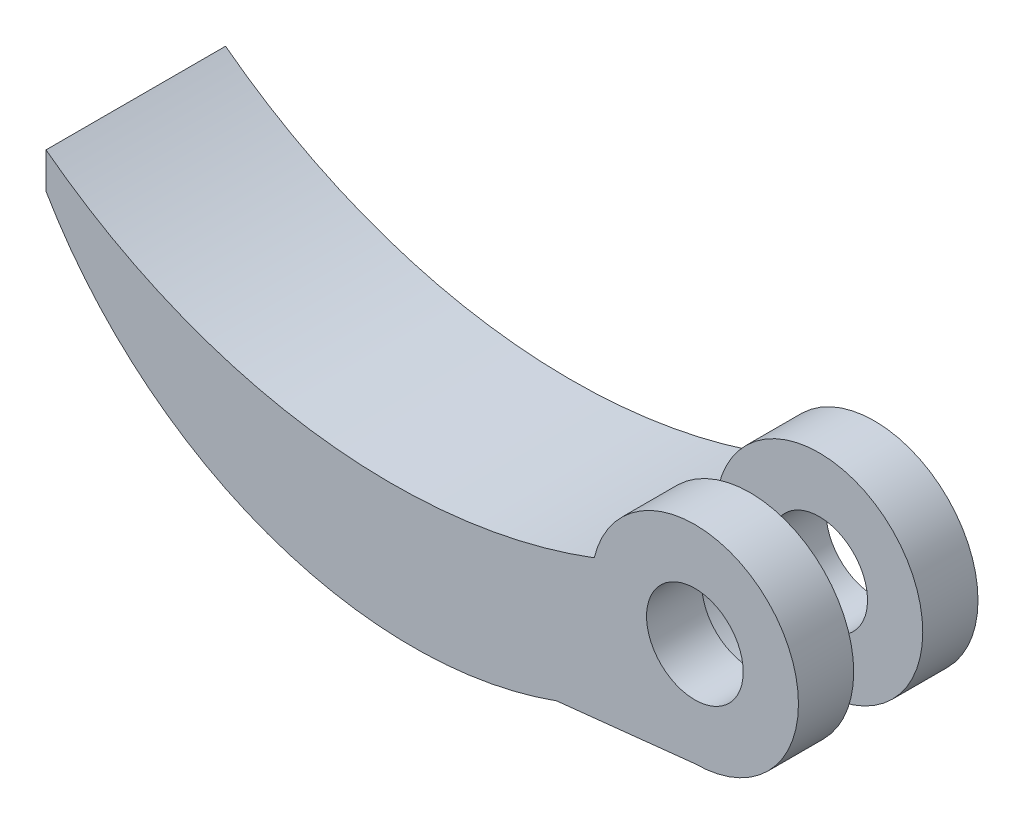
ISO-10303-21;
HEADER;
FILE_DESCRIPTION(('STEP AP214'),'2;1');
FILE_NAME('part.step','',(''),(''),'','','');
FILE_SCHEMA(('AUTOMOTIVE_DESIGN { 1 0 10303 214 1 1 1 1 }'));
ENDSEC;
DATA;
#1=APPLICATION_CONTEXT('core data for automotive mechanical design processes');
#2=APPLICATION_PROTOCOL_DEFINITION('international standard','automotive_design',2000,#1);
#3=PRODUCT_CONTEXT('',#1,'mechanical');
#4=PRODUCT('Part','Part','',(#3));
#5=PRODUCT_RELATED_PRODUCT_CATEGORY('part','',(#4));
#6=PRODUCT_DEFINITION_FORMATION('','',#4);
#7=PRODUCT_DEFINITION_CONTEXT('part definition',#1,'design');
#8=PRODUCT_DEFINITION('design','',#6,#7);
#9=PRODUCT_DEFINITION_SHAPE('','',#8);
#10=(LENGTH_UNIT() NAMED_UNIT(*) SI_UNIT(.MILLI.,.METRE.));
#11=(NAMED_UNIT(*) PLANE_ANGLE_UNIT() SI_UNIT($,.RADIAN.));
#12=(NAMED_UNIT(*) SI_UNIT($,.STERADIAN.) SOLID_ANGLE_UNIT());
#13=UNCERTAINTY_MEASURE_WITH_UNIT(LENGTH_MEASURE(1.E-05),#10,'distance_accuracy_value','');
#14=(GEOMETRIC_REPRESENTATION_CONTEXT(3) GLOBAL_UNCERTAINTY_ASSIGNED_CONTEXT((#13)) GLOBAL_UNIT_ASSIGNED_CONTEXT((#10,
#11,#12)) REPRESENTATION_CONTEXT('',''));
#15=CARTESIAN_POINT('',(0.,0.,0.));
#16=DIRECTION('',(0.,0.,1.));
#17=DIRECTION('',(1.,0.,0.));
#18=AXIS2_PLACEMENT_3D('',#15,#16,#17);
#19=CARTESIAN_POINT('',(0.,0.,-9.));
#20=DIRECTION('',(0.,0.,1.));
#21=DIRECTION('',(1.,0.,0.));
#22=AXIS2_PLACEMENT_3D('',#19,#20,#21);
#23=CYLINDRICAL_SURFACE('',#22,7.5);
#24=DIRECTION('',(0.,0.,1.));
#25=VECTOR('',#24,1.);
#26=CARTESIAN_POINT('',(0.,-7.5,-9.));
#27=LINE('',#26,#25);
#28=CARTESIAN_POINT('',(0.,-7.5,-5.));
#29=VERTEX_POINT('',#28);
#30=CARTESIAN_POINT('',(0.,-7.5,0.));
#31=VERTEX_POINT('',#30);
#32=EDGE_CURVE('E59',#29,#31,#27,.T.);
#33=ORIENTED_EDGE('',*,*,#32,.F.);
#34=CARTESIAN_POINT('',(0.,0.,-5.));
#35=DIRECTION('',(0.,0.,-1.));
#36=DIRECTION('',(-1.,0.,0.));
#37=AXIS2_PLACEMENT_3D('',#34,#35,#36);
#38=CIRCLE('',#37,7.5);
#39=CARTESIAN_POINT('',(-7.28877143549675,1.76743060997776,-5.));
#40=VERTEX_POINT('',#39);
#41=EDGE_CURVE('E54',#29,#40,#38,.T.);
#42=ORIENTED_EDGE('',*,*,#41,.T.);
#43=DIRECTION('',(0.,0.,1.));
#44=VECTOR('',#43,1.);
#45=CARTESIAN_POINT('',(-7.28877143549675,1.76743060997776,-9.));
#46=LINE('',#45,#44);
#47=CARTESIAN_POINT('',(-7.28877143549675,1.76743060997776,0.));
#48=VERTEX_POINT('',#47);
#49=EDGE_CURVE('E115',#40,#48,#46,.T.);
#50=ORIENTED_EDGE('',*,*,#49,.T.);
#51=CARTESIAN_POINT('',(0.,0.,0.));
#52=DIRECTION('',(0.,0.,1.));
#53=DIRECTION('',(1.,0.,0.));
#54=AXIS2_PLACEMENT_3D('',#51,#52,#53);
#55=CIRCLE('',#54,7.5);
#56=EDGE_CURVE('E163',#48,#31,#55,.T.);
#57=ORIENTED_EDGE('',*,*,#56,.T.);
#58=EDGE_LOOP('',(#33,#42,#50,#57));
#59=FACE_BOUND('',#58,.T.);
#60=ADVANCED_FACE('F39',(#59),#23,.F.);
#61=CARTESIAN_POINT('',(0.,0.,4.));
#62=DIRECTION('',(0.,0.,1.));
#63=DIRECTION('',(1.,0.,0.));
#64=AXIS2_PLACEMENT_3D('',#61,#62,#63);
#65=PLANE('',#64);
#66=CARTESIAN_POINT('',(0.,0.,4.));
#67=DIRECTION('',(0.,0.,1.));
#68=DIRECTION('',(1.,0.,0.));
#69=AXIS2_PLACEMENT_3D('',#66,#67,#68);
#70=CIRCLE('',#69,7.5);
#71=CARTESIAN_POINT('',(0.,-7.5,4.));
#72=VERTEX_POINT('',#71);
#73=CARTESIAN_POINT('',(-7.28877143549675,1.76743060997776,4.));
#74=VERTEX_POINT('',#73);
#75=EDGE_CURVE('E160',#72,#74,#70,.T.);
#76=ORIENTED_EDGE('',*,*,#75,.T.);
#77=CARTESIAN_POINT('',(-21.9545188477538,40.5061940782808,4.));
#78=DIRECTION('',(0.,0.,-1.));
#79=DIRECTION('',(-1.,0.,0.));
#80=AXIS2_PLACEMENT_3D('',#77,#78,#79);
#81=CIRCLE('',#80,41.4219258631616);
#82=CARTESIAN_POINT('',(-46.9818458061031,7.49999999999999,4.));
#83=VERTEX_POINT('',#82);
#84=EDGE_CURVE('E143',#74,#83,#81,.T.);
#85=ORIENTED_EDGE('',*,*,#84,.T.);
#86=DIRECTION('',(0.,-1.,0.));
#87=VECTOR('',#86,1.);
#88=CARTESIAN_POINT('',(-46.9818458061031,4.90393409006629,4.));
#89=LINE('',#88,#87);
#90=CARTESIAN_POINT('',(-46.9818458061031,4.90393409006629,4.));
#91=VERTEX_POINT('',#90);
#92=EDGE_CURVE('E138',#83,#91,#89,.T.);
#93=ORIENTED_EDGE('',*,*,#92,.T.);
#94=CARTESIAN_POINT('',(-20.4372430160604,20.2856612233375,4.));
#95=DIRECTION('',(0.,0.,1.));
#96=DIRECTION('',(-1.,0.,0.));
#97=AXIS2_PLACEMENT_3D('',#94,#95,#96);
#98=CIRCLE('',#97,30.679202513813);
#99=CARTESIAN_POINT('',(-10.009282788127,-8.56691426600475,4.));
#100=VERTEX_POINT('',#99);
#101=EDGE_CURVE('E124',#91,#100,#98,.T.);
#102=ORIENTED_EDGE('',*,*,#101,.T.);
#103=DIRECTION('',(0.994366978123419,0.105992041294143,0.));
#104=VECTOR('',#103,1.);
#105=CARTESIAN_POINT('',(-10.009282788127,-8.56691426600475,4.));
#106=LINE('',#105,#104);
#107=EDGE_CURVE('E128',#100,#72,#106,.T.);
#108=ORIENTED_EDGE('',*,*,#107,.T.);
#109=EDGE_LOOP('',(#76,#85,#93,#102,#108));
#110=FACE_BOUND('',#109,.T.);
#111=CARTESIAN_POINT('',(0.,0.,4.));
#112=DIRECTION('',(0.,0.,1.));
#113=DIRECTION('',(1.,0.,0.));
#114=AXIS2_PLACEMENT_3D('',#111,#112,#113);
#115=CIRCLE('',#114,3.5);
#116=CARTESIAN_POINT('',(3.5,0.,4.));
#117=VERTEX_POINT('',#116);
#118=EDGE_CURVE('E154',#117,#117,#115,.T.);
#119=ORIENTED_EDGE('',*,*,#118,.F.);
#120=EDGE_LOOP('',(#119));
#121=FACE_BOUND('',#120,.T.);
#122=ADVANCED_FACE('F177',(#110,#121),#65,.T.);
#123=CARTESIAN_POINT('',(0.,0.,0.));
#124=DIRECTION('',(0.,0.,1.));
#125=DIRECTION('',(1.,0.,0.));
#126=AXIS2_PLACEMENT_3D('',#123,#124,#125);
#127=PLANE('',#126);
#128=ORIENTED_EDGE('',*,*,#56,.F.);
#129=EDGE_CURVE('E157',#31,#48,#55,.T.);
#130=ORIENTED_EDGE('',*,*,#129,.F.);
#131=EDGE_LOOP('',(#128,#130));
#132=FACE_BOUND('',#131,.T.);
#133=CARTESIAN_POINT('',(0.,0.,0.));
#134=DIRECTION('',(0.,0.,1.));
#135=DIRECTION('',(1.,0.,0.));
#136=AXIS2_PLACEMENT_3D('',#133,#134,#135);
#137=CIRCLE('',#136,3.5);
#138=CARTESIAN_POINT('',(3.5,0.,0.));
#139=VERTEX_POINT('',#138);
#140=EDGE_CURVE('E150',#139,#139,#137,.T.);
#141=ORIENTED_EDGE('',*,*,#140,.T.);
#142=EDGE_LOOP('',(#141));
#143=FACE_BOUND('',#142,.T.);
#144=ADVANCED_FACE('F174',(#132,#143),#127,.F.);
#145=CARTESIAN_POINT('',(0.,0.,4.));
#146=DIRECTION('',(0.,0.,-1.));
#147=DIRECTION('',(-1.,0.,0.));
#148=AXIS2_PLACEMENT_3D('',#145,#146,#147);
#149=CYLINDRICAL_SURFACE('',#148,7.5);
#150=ORIENTED_EDGE('',*,*,#129,.T.);
#151=DIRECTION('',(0.,0.,1.));
#152=VECTOR('',#151,1.);
#153=CARTESIAN_POINT('',(-7.28877143549678,1.76743060997776,-2.5));
#154=LINE('',#153,#152);
#155=EDGE_CURVE('E11',#48,#74,#154,.T.);
#156=ORIENTED_EDGE('',*,*,#155,.T.);
#157=ORIENTED_EDGE('',*,*,#75,.F.);
#158=DIRECTION('',(0.,0.,-1.));
#159=VECTOR('',#158,1.);
#160=CARTESIAN_POINT('',(0.,-7.5,4.));
#161=LINE('',#160,#159);
#162=EDGE_CURVE('E47',#72,#31,#161,.T.);
#163=ORIENTED_EDGE('',*,*,#162,.T.);
#164=EDGE_LOOP('',(#150,#156,#157,#163));
#165=FACE_BOUND('',#164,.T.);
#166=ADVANCED_FACE('F41',(#165),#149,.T.);
#167=CARTESIAN_POINT('',(0.,0.,4.));
#168=DIRECTION('',(0.,0.,-1.));
#169=DIRECTION('',(-1.,0.,0.));
#170=AXIS2_PLACEMENT_3D('',#167,#168,#169);
#171=CYLINDRICAL_SURFACE('',#170,3.5);
#172=ORIENTED_EDGE('',*,*,#118,.T.);
#173=EDGE_LOOP('',(#172));
#174=FACE_BOUND('',#173,.T.);
#175=ORIENTED_EDGE('',*,*,#140,.F.);
#176=EDGE_LOOP('',(#175));
#177=FACE_BOUND('',#176,.T.);
#178=ADVANCED_FACE('F193',(#174,#177),#171,.F.);
#179=CARTESIAN_POINT('',(-20.4372430160604,20.2856612233375,-9.));
#180=DIRECTION('',(0.,0.,1.));
#181=DIRECTION('',(1.,0.,0.));
#182=AXIS2_PLACEMENT_3D('',#179,#180,#181);
#183=CYLINDRICAL_SURFACE('',#182,30.679202513813);
#184=ORIENTED_EDGE('',*,*,#101,.F.);
#185=DIRECTION('',(0.,0.,1.));
#186=VECTOR('',#185,1.);
#187=CARTESIAN_POINT('',(-46.9818458061031,4.90393409006629,-9.));
#188=LINE('',#187,#186);
#189=CARTESIAN_POINT('',(-46.9818458061031,4.90393409006629,-9.));
#190=VERTEX_POINT('',#189);
#191=EDGE_CURVE('E148',#190,#91,#188,.T.);
#192=ORIENTED_EDGE('',*,*,#191,.F.);
#193=CARTESIAN_POINT('',(-20.4372430160604,20.2856612233375,-9.));
#194=DIRECTION('',(0.,0.,1.));
#195=DIRECTION('',(-1.,0.,0.));
#196=AXIS2_PLACEMENT_3D('',#193,#194,#195);
#197=CIRCLE('',#196,30.679202513813);
#198=CARTESIAN_POINT('',(-10.009282788127,-8.56691426600475,-9.));
#199=VERTEX_POINT('',#198);
#200=EDGE_CURVE('E135',#190,#199,#197,.T.);
#201=ORIENTED_EDGE('',*,*,#200,.T.);
#202=DIRECTION('',(0.,0.,1.));
#203=VECTOR('',#202,1.);
#204=CARTESIAN_POINT('',(-10.009282788127,-8.56691426600475,-9.));
#205=LINE('',#204,#203);
#206=EDGE_CURVE('E140',#199,#100,#205,.T.);
#207=ORIENTED_EDGE('',*,*,#206,.T.);
#208=EDGE_LOOP('',(#184,#192,#201,#207));
#209=FACE_BOUND('',#208,.T.);
#210=ADVANCED_FACE('F183',(#209),#183,.T.);
#211=CARTESIAN_POINT('',(-46.9818458061031,4.90393409006629,-9.));
#212=DIRECTION('',(-1.,0.,0.));
#213=DIRECTION('',(0.,0.,1.));
#214=AXIS2_PLACEMENT_3D('',#211,#212,#213);
#215=PLANE('',#214);
#216=ORIENTED_EDGE('',*,*,#92,.F.);
#217=DIRECTION('',(0.,0.,1.));
#218=VECTOR('',#217,1.);
#219=CARTESIAN_POINT('',(-46.9818458061031,7.49999999999999,-9.));
#220=LINE('',#219,#218);
#221=CARTESIAN_POINT('',(-46.9818458061031,7.49999999999999,-9.));
#222=VERTEX_POINT('',#221);
#223=EDGE_CURVE('E119',#222,#83,#220,.T.);
#224=ORIENTED_EDGE('',*,*,#223,.F.);
#225=DIRECTION('',(0.,-1.,0.));
#226=VECTOR('',#225,1.);
#227=CARTESIAN_POINT('',(-46.9818458061031,4.90393409006629,-9.));
#228=LINE('',#227,#226);
#229=EDGE_CURVE('E107',#222,#190,#228,.T.);
#230=ORIENTED_EDGE('',*,*,#229,.T.);
#231=ORIENTED_EDGE('',*,*,#191,.T.);
#232=EDGE_LOOP('',(#216,#224,#230,#231));
#233=FACE_BOUND('',#232,.T.);
#234=ADVANCED_FACE('F185',(#233),#215,.T.);
#235=CARTESIAN_POINT('',(-21.9545188477538,40.5061940782808,-9.));
#236=DIRECTION('',(0.,0.,1.));
#237=DIRECTION('',(1.,0.,0.));
#238=AXIS2_PLACEMENT_3D('',#235,#236,#237);
#239=CYLINDRICAL_SURFACE('',#238,41.4219258631616);
#240=ORIENTED_EDGE('',*,*,#84,.F.);
#241=ORIENTED_EDGE('',*,*,#155,.F.);
#242=ORIENTED_EDGE('',*,*,#49,.F.);
#243=CARTESIAN_POINT('',(-7.28877143549677,1.76743060997776,-9.));
#244=VERTEX_POINT('',#243);
#245=EDGE_CURVE('E112',#244,#40,#46,.T.);
#246=ORIENTED_EDGE('',*,*,#245,.F.);
#247=CARTESIAN_POINT('',(-21.9545188477538,40.5061940782808,-9.));
#248=DIRECTION('',(0.,0.,-1.));
#249=DIRECTION('',(-1.,0.,0.));
#250=AXIS2_PLACEMENT_3D('',#247,#248,#249);
#251=CIRCLE('',#250,41.4219258631616);
#252=EDGE_CURVE('E98',#244,#222,#251,.T.);
#253=ORIENTED_EDGE('',*,*,#252,.T.);
#254=ORIENTED_EDGE('',*,*,#223,.T.);
#255=EDGE_LOOP('',(#240,#241,#242,#246,#253,#254));
#256=FACE_BOUND('',#255,.T.);
#257=ADVANCED_FACE('F113',(#256),#239,.F.);
#258=CARTESIAN_POINT('',(-10.009282788127,-8.56691426600475,-9.));
#259=DIRECTION('',(0.105992041294143,-0.994366978123419,0.));
#260=DIRECTION('',(0.994366978123419,0.105992041294143,0.));
#261=AXIS2_PLACEMENT_3D('',#258,#259,#260);
#262=PLANE('',#261);
#263=ORIENTED_EDGE('',*,*,#107,.F.);
#264=ORIENTED_EDGE('',*,*,#206,.F.);
#265=DIRECTION('',(0.994366978123419,0.105992041294143,0.));
#266=VECTOR('',#265,1.);
#267=CARTESIAN_POINT('',(-10.009282788127,-8.56691426600475,-9.));
#268=LINE('',#267,#266);
#269=CARTESIAN_POINT('',(0.,-7.5,-9.));
#270=VERTEX_POINT('',#269);
#271=EDGE_CURVE('E109',#199,#270,#268,.T.);
#272=ORIENTED_EDGE('',*,*,#271,.T.);
#273=EDGE_CURVE('E123',#270,#29,#27,.T.);
#274=ORIENTED_EDGE('',*,*,#273,.T.);
#275=ORIENTED_EDGE('',*,*,#32,.T.);
#276=ORIENTED_EDGE('',*,*,#162,.F.);
#277=EDGE_LOOP('',(#263,#264,#272,#274,#275,#276));
#278=FACE_BOUND('',#277,.T.);
#279=ADVANCED_FACE('F181',(#278),#262,.T.);
#280=CARTESIAN_POINT('',(-20.4372430160604,20.2856612233375,-9.));
#281=DIRECTION('',(0.,0.,-1.));
#282=DIRECTION('',(-1.,0.,0.));
#283=AXIS2_PLACEMENT_3D('',#280,#281,#282);
#284=PLANE('',#283);
#285=ORIENTED_EDGE('',*,*,#200,.F.);
#286=ORIENTED_EDGE('',*,*,#229,.F.);
#287=ORIENTED_EDGE('',*,*,#252,.F.);
#288=CARTESIAN_POINT('',(0.,0.,-9.));
#289=DIRECTION('',(0.,0.,-1.));
#290=DIRECTION('',(-1.,0.,0.));
#291=AXIS2_PLACEMENT_3D('',#288,#289,#290);
#292=CIRCLE('',#291,7.5);
#293=EDGE_CURVE('E105',#244,#270,#292,.T.);
#294=ORIENTED_EDGE('',*,*,#293,.T.);
#295=ORIENTED_EDGE('',*,*,#271,.F.);
#296=EDGE_LOOP('',(#285,#286,#287,#294,#295));
#297=FACE_BOUND('',#296,.T.);
#298=CARTESIAN_POINT('',(0.,0.,-9.));
#299=DIRECTION('',(0.,0.,-1.));
#300=DIRECTION('',(-1.,0.,0.));
#301=AXIS2_PLACEMENT_3D('',#298,#299,#300);
#302=CIRCLE('',#301,3.5);
#303=CARTESIAN_POINT('',(-3.5,0.,-9.));
#304=VERTEX_POINT('',#303);
#305=EDGE_CURVE('E303',#304,#304,#302,.T.);
#306=ORIENTED_EDGE('',*,*,#305,.F.);
#307=EDGE_LOOP('',(#306));
#308=FACE_BOUND('',#307,.T.);
#309=ADVANCED_FACE('F101',(#297,#308),#284,.T.);
#310=CARTESIAN_POINT('',(0.,0.,-5.));
#311=DIRECTION('',(0.,0.,-1.));
#312=DIRECTION('',(-1.,0.,0.));
#313=AXIS2_PLACEMENT_3D('',#310,#311,#312);
#314=PLANE('',#313);
#315=EDGE_CURVE('E125',#40,#29,#38,.T.);
#316=ORIENTED_EDGE('',*,*,#315,.F.);
#317=ORIENTED_EDGE('',*,*,#41,.F.);
#318=EDGE_LOOP('',(#316,#317));
#319=FACE_BOUND('',#318,.T.);
#320=CARTESIAN_POINT('',(0.,0.,-5.));
#321=DIRECTION('',(0.,0.,-1.));
#322=DIRECTION('',(-1.,0.,0.));
#323=AXIS2_PLACEMENT_3D('',#320,#321,#322);
#324=CIRCLE('',#323,3.5);
#325=CARTESIAN_POINT('',(-3.5,0.,-5.));
#326=VERTEX_POINT('',#325);
#327=EDGE_CURVE('E132',#326,#326,#324,.T.);
#328=ORIENTED_EDGE('',*,*,#327,.T.);
#329=EDGE_LOOP('',(#328));
#330=FACE_BOUND('',#329,.T.);
#331=ADVANCED_FACE('F247',(#319,#330),#314,.F.);
#332=CARTESIAN_POINT('',(0.,0.,-9.));
#333=DIRECTION('',(0.,0.,1.));
#334=DIRECTION('',(1.,0.,0.));
#335=AXIS2_PLACEMENT_3D('',#332,#333,#334);
#336=CYLINDRICAL_SURFACE('',#335,7.5);
#337=ORIENTED_EDGE('',*,*,#245,.T.);
#338=ORIENTED_EDGE('',*,*,#315,.T.);
#339=ORIENTED_EDGE('',*,*,#273,.F.);
#340=ORIENTED_EDGE('',*,*,#293,.F.);
#341=EDGE_LOOP('',(#337,#338,#339,#340));
#342=FACE_BOUND('',#341,.T.);
#343=ADVANCED_FACE('F122',(#342),#336,.T.);
#344=CARTESIAN_POINT('',(0.,0.,-9.));
#345=DIRECTION('',(0.,0.,1.));
#346=DIRECTION('',(1.,0.,0.));
#347=AXIS2_PLACEMENT_3D('',#344,#345,#346);
#348=CYLINDRICAL_SURFACE('',#347,3.5);
#349=ORIENTED_EDGE('',*,*,#305,.T.);
#350=EDGE_LOOP('',(#349));
#351=FACE_BOUND('',#350,.T.);
#352=ORIENTED_EDGE('',*,*,#327,.F.);
#353=EDGE_LOOP('',(#352));
#354=FACE_BOUND('',#353,.T.);
#355=ADVANCED_FACE('F265',(#351,#354),#348,.F.);
#356=CLOSED_SHELL('',(#60,#122,#144,#166,#178,#210,#234,#257,#279,#309,#331,#343,#355));
#357=MANIFOLD_SOLID_BREP('B2',#356);
#358=ADVANCED_BREP_SHAPE_REPRESENTATION('',(#18,#357),#14);
#359=SHAPE_DEFINITION_REPRESENTATION(#9,#358);
ENDSEC;
END-ISO-10303-21;
